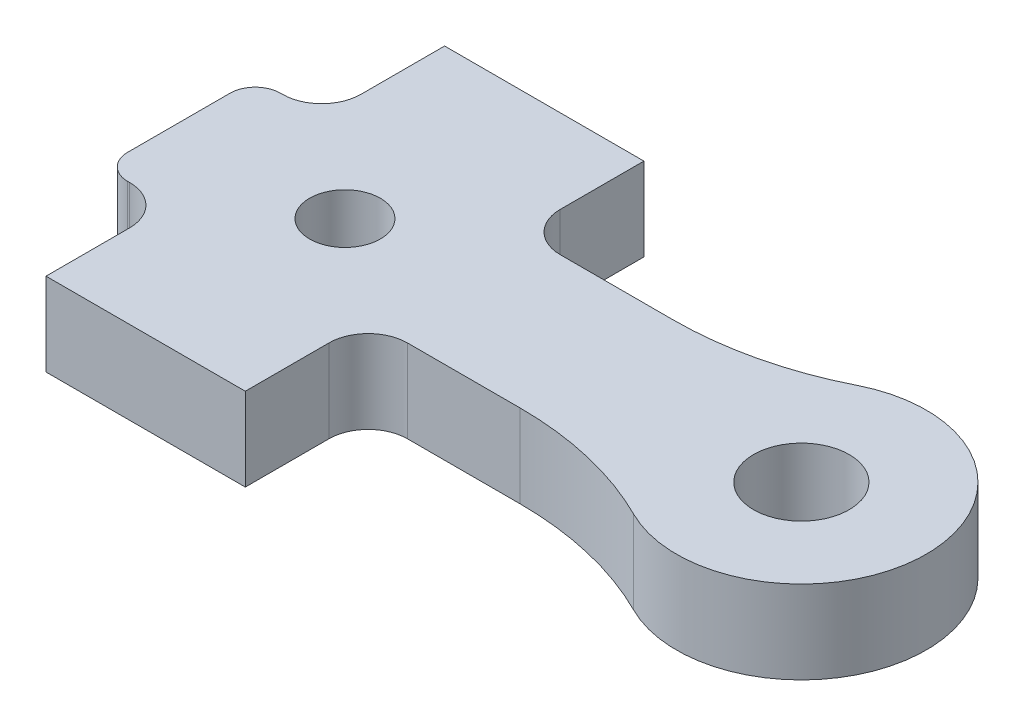
ISO-10303-21;
HEADER;
FILE_DESCRIPTION(('STEP AP214'),'2;1');
FILE_NAME('part.step','',(''),(''),'','','');
FILE_SCHEMA(('AUTOMOTIVE_DESIGN { 1 0 10303 214 1 1 1 1 }'));
ENDSEC;
DATA;
#1=APPLICATION_CONTEXT('core data for automotive mechanical design processes');
#2=APPLICATION_PROTOCOL_DEFINITION('international standard','automotive_design',2000,#1);
#3=PRODUCT_CONTEXT('',#1,'mechanical');
#4=PRODUCT('Part','Part','',(#3));
#5=PRODUCT_RELATED_PRODUCT_CATEGORY('part','',(#4));
#6=PRODUCT_DEFINITION_FORMATION('','',#4);
#7=PRODUCT_DEFINITION_CONTEXT('part definition',#1,'design');
#8=PRODUCT_DEFINITION('design','',#6,#7);
#9=PRODUCT_DEFINITION_SHAPE('','',#8);
#10=(LENGTH_UNIT() NAMED_UNIT(*) SI_UNIT(.MILLI.,.METRE.));
#11=(NAMED_UNIT(*) PLANE_ANGLE_UNIT() SI_UNIT($,.RADIAN.));
#12=(NAMED_UNIT(*) SI_UNIT($,.STERADIAN.) SOLID_ANGLE_UNIT());
#13=UNCERTAINTY_MEASURE_WITH_UNIT(LENGTH_MEASURE(1.E-05),#10,'distance_accuracy_value','');
#14=(GEOMETRIC_REPRESENTATION_CONTEXT(3) GLOBAL_UNCERTAINTY_ASSIGNED_CONTEXT((#13)) GLOBAL_UNIT_ASSIGNED_CONTEXT((#10,
#11,#12)) REPRESENTATION_CONTEXT('',''));
#15=CARTESIAN_POINT('',(0.,0.,0.));
#16=DIRECTION('',(0.,0.,1.));
#17=DIRECTION('',(1.,0.,0.));
#18=AXIS2_PLACEMENT_3D('',#15,#16,#17);
#19=CARTESIAN_POINT('',(7.9375,3.175,0.));
#20=DIRECTION('',(0.,1.,0.));
#21=DIRECTION('',(1.,0.,0.));
#22=AXIS2_PLACEMENT_3D('',#19,#20,#21);
#23=PLANE('',#22);
#24=CARTESIAN_POINT('',(17.4498,3.175,0.));
#25=DIRECTION('',(0.,-1.,0.));
#26=DIRECTION('',(1.,0.,0.));
#27=AXIS2_PLACEMENT_3D('',#24,#25,#26);
#28=CIRCLE('',#27,1.8288);
#29=CARTESIAN_POINT('',(15.621,3.175,0.));
#30=VERTEX_POINT('',#29);
#31=EDGE_CURVE('E172',#30,#30,#28,.T.);
#32=ORIENTED_EDGE('',*,*,#31,.T.);
#33=EDGE_LOOP('',(#32));
#34=FACE_BOUND('',#33,.T.);
#35=CARTESIAN_POINT('',(0.,3.175,0.));
#36=DIRECTION('',(0.,-1.,0.));
#37=DIRECTION('',(1.,0.,0.));
#38=AXIS2_PLACEMENT_3D('',#35,#36,#37);
#39=CIRCLE('',#38,1.35255);
#40=CARTESIAN_POINT('',(-1.35255,3.175,0.));
#41=VERTEX_POINT('',#40);
#42=EDGE_CURVE('E159',#41,#41,#39,.T.);
#43=ORIENTED_EDGE('',*,*,#42,.T.);
#44=EDGE_LOOP('',(#43));
#45=FACE_BOUND('',#44,.T.);
#46=CARTESIAN_POINT('',(-5.3848,3.175,-1.9558));
#47=DIRECTION('',(0.,-1.,0.));
#48=DIRECTION('',(-0.707106781186547,0.,-0.707106781186548));
#49=AXIS2_PLACEMENT_3D('',#46,#47,#48);
#50=CIRCLE('',#49,0.9652);
#51=CARTESIAN_POINT('',(-6.35,3.175,-1.9558));
#52=VERTEX_POINT('',#51);
#53=CARTESIAN_POINT('',(-5.3848,3.175,-2.921));
#54=VERTEX_POINT('',#53);
#55=EDGE_CURVE('E204',#52,#54,#50,.T.);
#56=ORIENTED_EDGE('',*,*,#55,.F.);
#57=DIRECTION('',(0.,0.,1.));
#58=VECTOR('',#57,1.);
#59=CARTESIAN_POINT('',(-6.35,3.175,-2.921));
#60=LINE('',#59,#58);
#61=CARTESIAN_POINT('',(-6.35,3.175,1.9558));
#62=VERTEX_POINT('',#61);
#63=EDGE_CURVE('E246',#52,#62,#60,.T.);
#64=ORIENTED_EDGE('',*,*,#63,.T.);
#65=CARTESIAN_POINT('',(-5.3848,3.175,1.9558));
#66=DIRECTION('',(0.,-1.,0.));
#67=DIRECTION('',(-0.707106781186547,0.,0.707106781186548));
#68=AXIS2_PLACEMENT_3D('',#65,#66,#67);
#69=CIRCLE('',#68,0.9652);
#70=CARTESIAN_POINT('',(-5.3848,3.175,2.921));
#71=VERTEX_POINT('',#70);
#72=EDGE_CURVE('E209',#71,#62,#69,.T.);
#73=ORIENTED_EDGE('',*,*,#72,.F.);
#74=DIRECTION('',(1.,0.,0.));
#75=VECTOR('',#74,1.);
#76=CARTESIAN_POINT('',(-6.35,3.175,2.921));
#77=LINE('',#76,#75);
#78=CARTESIAN_POINT('',(-5.31,3.175,2.921));
#79=VERTEX_POINT('',#78);
#80=EDGE_CURVE('E11',#71,#79,#77,.T.);
#81=ORIENTED_EDGE('',*,*,#80,.T.);
#82=CARTESIAN_POINT('',(-5.31,3.175,4.421));
#83=DIRECTION('',(0.,1.,0.));
#84=DIRECTION('',(0.707106781186548,0.,-0.707106781186547));
#85=AXIS2_PLACEMENT_3D('',#82,#83,#84);
#86=CIRCLE('',#85,1.5);
#87=CARTESIAN_POINT('',(-3.81,3.175,4.421));
#88=VERTEX_POINT('',#87);
#89=EDGE_CURVE('E327',#88,#79,#86,.T.);
#90=ORIENTED_EDGE('',*,*,#89,.F.);
#91=DIRECTION('',(0.,0.,1.));
#92=VECTOR('',#91,1.);
#93=CARTESIAN_POINT('',(-3.81,3.175,7.62));
#94=LINE('',#93,#92);
#95=CARTESIAN_POINT('',(-3.81,3.175,7.62));
#96=VERTEX_POINT('',#95);
#97=EDGE_CURVE('E244',#88,#96,#94,.T.);
#98=ORIENTED_EDGE('',*,*,#97,.T.);
#99=DIRECTION('',(1.,0.,0.));
#100=VECTOR('',#99,1.);
#101=CARTESIAN_POINT('',(3.81,3.175,7.62));
#102=LINE('',#101,#100);
#103=CARTESIAN_POINT('',(3.81,3.175,7.62));
#104=VERTEX_POINT('',#103);
#105=EDGE_CURVE('E26',#96,#104,#102,.T.);
#106=ORIENTED_EDGE('',*,*,#105,.T.);
#107=DIRECTION('',(0.,0.,-1.));
#108=VECTOR('',#107,1.);
#109=CARTESIAN_POINT('',(3.81,3.175,-7.62));
#110=LINE('',#109,#108);
#111=CARTESIAN_POINT('',(3.81,3.175,4.421));
#112=VERTEX_POINT('',#111);
#113=EDGE_CURVE('E218',#104,#112,#110,.T.);
#114=ORIENTED_EDGE('',*,*,#113,.T.);
#115=CARTESIAN_POINT('',(5.31,3.175,4.421));
#116=DIRECTION('',(0.,1.,0.));
#117=DIRECTION('',(-0.707106781186548,0.,-0.707106781186547));
#118=AXIS2_PLACEMENT_3D('',#115,#116,#117);
#119=CIRCLE('',#118,1.5);
#120=CARTESIAN_POINT('',(5.31,3.175,2.921));
#121=VERTEX_POINT('',#120);
#122=EDGE_CURVE('E282',#121,#112,#119,.T.);
#123=ORIENTED_EDGE('',*,*,#122,.F.);
#124=DIRECTION('',(1.,0.,0.));
#125=VECTOR('',#124,1.);
#126=CARTESIAN_POINT('',(-6.35,3.175,2.921));
#127=LINE('',#126,#125);
#128=CARTESIAN_POINT('',(9.61609244610192,3.175,2.921));
#129=VERTEX_POINT('',#128);
#130=EDGE_CURVE('E232',#121,#129,#127,.T.);
#131=ORIENTED_EDGE('',*,*,#130,.T.);
#132=CARTESIAN_POINT('',(9.61609244610192,3.175,15.621));
#133=DIRECTION('',(0.,1.,0.));
#134=DIRECTION('',(0.230330904529538,0.,-0.973112364744486));
#135=AXIS2_PLACEMENT_3D('',#132,#133,#134);
#136=CIRCLE('',#135,12.7);
#137=CARTESIAN_POINT('',(15.309193866086,3.175,4.26852906976744));
#138=VERTEX_POINT('',#137);
#139=EDGE_CURVE('E274',#138,#129,#136,.T.);
#140=ORIENTED_EDGE('',*,*,#139,.F.);
#141=CARTESIAN_POINT('',(17.4498,3.175,0.));
#142=DIRECTION('',(0.,1.,0.));
#143=DIRECTION('',(1.,0.,0.));
#144=AXIS2_PLACEMENT_3D('',#141,#142,#143);
#145=CIRCLE('',#144,4.7752);
#146=CARTESIAN_POINT('',(15.309193866086,3.175,-4.26852906976744));
#147=VERTEX_POINT('',#146);
#148=EDGE_CURVE('E277',#138,#147,#145,.T.);
#149=ORIENTED_EDGE('',*,*,#148,.T.);
#150=CARTESIAN_POINT('',(9.61609244610192,3.175,-15.621));
#151=DIRECTION('',(0.,1.,0.));
#152=DIRECTION('',(0.230330904529538,0.,0.973112364744486));
#153=AXIS2_PLACEMENT_3D('',#150,#151,#152);
#154=CIRCLE('',#153,12.7);
#155=CARTESIAN_POINT('',(9.61609244610192,3.175,-2.921));
#156=VERTEX_POINT('',#155);
#157=EDGE_CURVE('E187',#156,#147,#154,.T.);
#158=ORIENTED_EDGE('',*,*,#157,.F.);
#159=DIRECTION('',(-1.,0.,0.));
#160=VECTOR('',#159,1.);
#161=CARTESIAN_POINT('',(22.225,3.175,-2.921));
#162=LINE('',#161,#160);
#163=CARTESIAN_POINT('',(5.31,3.175,-2.921));
#164=VERTEX_POINT('',#163);
#165=EDGE_CURVE('E239',#156,#164,#162,.T.);
#166=ORIENTED_EDGE('',*,*,#165,.T.);
#167=CARTESIAN_POINT('',(5.31,3.175,-4.421));
#168=DIRECTION('',(0.,1.,0.));
#169=DIRECTION('',(-0.707106781186548,0.,0.707106781186547));
#170=AXIS2_PLACEMENT_3D('',#167,#168,#169);
#171=CIRCLE('',#170,1.5);
#172=CARTESIAN_POINT('',(3.81,3.175,-4.421));
#173=VERTEX_POINT('',#172);
#174=EDGE_CURVE('E185',#173,#164,#171,.T.);
#175=ORIENTED_EDGE('',*,*,#174,.F.);
#176=DIRECTION('',(0.,0.,-1.));
#177=VECTOR('',#176,1.);
#178=CARTESIAN_POINT('',(3.81,3.175,-7.62));
#179=LINE('',#178,#177);
#180=CARTESIAN_POINT('',(3.81,3.175,-7.62));
#181=VERTEX_POINT('',#180);
#182=EDGE_CURVE('E198',#173,#181,#179,.T.);
#183=ORIENTED_EDGE('',*,*,#182,.T.);
#184=DIRECTION('',(-1.,0.,0.));
#185=VECTOR('',#184,1.);
#186=CARTESIAN_POINT('',(-3.81,3.175,-7.62));
#187=LINE('',#186,#185);
#188=CARTESIAN_POINT('',(-3.81,3.175,-7.62));
#189=VERTEX_POINT('',#188);
#190=EDGE_CURVE('E215',#181,#189,#187,.T.);
#191=ORIENTED_EDGE('',*,*,#190,.T.);
#192=DIRECTION('',(0.,0.,1.));
#193=VECTOR('',#192,1.);
#194=CARTESIAN_POINT('',(-3.81,3.175,7.62));
#195=LINE('',#194,#193);
#196=CARTESIAN_POINT('',(-3.81,3.175,-4.421));
#197=VERTEX_POINT('',#196);
#198=EDGE_CURVE('E163',#189,#197,#195,.T.);
#199=ORIENTED_EDGE('',*,*,#198,.T.);
#200=CARTESIAN_POINT('',(-5.31,3.175,-4.421));
#201=DIRECTION('',(0.,1.,0.));
#202=DIRECTION('',(0.707106781186548,0.,0.707106781186547));
#203=AXIS2_PLACEMENT_3D('',#200,#201,#202);
#204=CIRCLE('',#203,1.5);
#205=CARTESIAN_POINT('',(-5.31,3.175,-2.921));
#206=VERTEX_POINT('',#205);
#207=EDGE_CURVE('E180',#206,#197,#204,.T.);
#208=ORIENTED_EDGE('',*,*,#207,.F.);
#209=DIRECTION('',(-1.,0.,0.));
#210=VECTOR('',#209,1.);
#211=CARTESIAN_POINT('',(22.225,3.175,-2.921));
#212=LINE('',#211,#210);
#213=EDGE_CURVE('E295',#206,#54,#212,.T.);
#214=ORIENTED_EDGE('',*,*,#213,.T.);
#215=EDGE_LOOP('',(#56,#64,#73,#81,#90,#98,#106,#114,#123,#131,#140,#149,#158,#166,#175,#183,
#191,#199,#208,#214));
#216=FACE_BOUND('',#215,.T.);
#217=ADVANCED_FACE('F16',(#34,#45,#216),#23,.T.);
#218=CARTESIAN_POINT('',(-6.35,0.,2.921));
#219=DIRECTION('',(0.,0.,1.));
#220=DIRECTION('',(1.,0.,0.));
#221=AXIS2_PLACEMENT_3D('',#218,#219,#220);
#222=PLANE('',#221);
#223=DIRECTION('',(0.,-1.,0.));
#224=VECTOR('',#223,1.);
#225=CARTESIAN_POINT('',(-5.31,0.,2.921));
#226=LINE('',#225,#224);
#227=CARTESIAN_POINT('',(-5.31,0.,2.921));
#228=VERTEX_POINT('',#227);
#229=EDGE_CURVE('E323',#79,#228,#226,.T.);
#230=ORIENTED_EDGE('',*,*,#229,.F.);
#231=ORIENTED_EDGE('',*,*,#80,.F.);
#232=DIRECTION('',(0.,1.,0.));
#233=VECTOR('',#232,1.);
#234=CARTESIAN_POINT('',(-5.3848,0.,2.921));
#235=LINE('',#234,#233);
#236=CARTESIAN_POINT('',(-5.3848,0.,2.921));
#237=VERTEX_POINT('',#236);
#238=EDGE_CURVE('E205',#237,#71,#235,.T.);
#239=ORIENTED_EDGE('',*,*,#238,.F.);
#240=DIRECTION('',(1.,0.,0.));
#241=VECTOR('',#240,1.);
#242=CARTESIAN_POINT('',(-6.35,0.,2.921));
#243=LINE('',#242,#241);
#244=EDGE_CURVE('E300',#237,#228,#243,.T.);
#245=ORIENTED_EDGE('',*,*,#244,.T.);
#246=EDGE_LOOP('',(#230,#231,#239,#245));
#247=FACE_BOUND('',#246,.T.);
#248=ADVANCED_FACE('F393',(#247),#222,.T.);
#249=CARTESIAN_POINT('',(-3.81,0.,7.62));
#250=DIRECTION('',(0.,0.,1.));
#251=DIRECTION('',(1.,0.,0.));
#252=AXIS2_PLACEMENT_3D('',#249,#250,#251);
#253=PLANE('',#252);
#254=DIRECTION('',(-1.,0.,0.));
#255=VECTOR('',#254,1.);
#256=CARTESIAN_POINT('',(3.81,0.,7.62));
#257=LINE('',#256,#255);
#258=CARTESIAN_POINT('',(3.81,0.,7.62));
#259=VERTEX_POINT('',#258);
#260=CARTESIAN_POINT('',(-3.81,0.,7.62));
#261=VERTEX_POINT('',#260);
#262=EDGE_CURVE('E338',#259,#261,#257,.T.);
#263=ORIENTED_EDGE('',*,*,#262,.F.);
#264=DIRECTION('',(0.,1.,0.));
#265=VECTOR('',#264,1.);
#266=CARTESIAN_POINT('',(3.81,0.,7.62));
#267=LINE('',#266,#265);
#268=EDGE_CURVE('E301',#259,#104,#267,.T.);
#269=ORIENTED_EDGE('',*,*,#268,.T.);
#270=ORIENTED_EDGE('',*,*,#105,.F.);
#271=DIRECTION('',(0.,1.,0.));
#272=VECTOR('',#271,1.);
#273=CARTESIAN_POINT('',(-3.81,0.,7.62));
#274=LINE('',#273,#272);
#275=EDGE_CURVE('E240',#261,#96,#274,.T.);
#276=ORIENTED_EDGE('',*,*,#275,.F.);
#277=EDGE_LOOP('',(#263,#269,#270,#276));
#278=FACE_BOUND('',#277,.T.);
#279=ADVANCED_FACE('F531',(#278),#253,.T.);
#280=CARTESIAN_POINT('',(3.81,0.,7.62));
#281=DIRECTION('',(1.,0.,0.));
#282=DIRECTION('',(0.,1.,0.));
#283=AXIS2_PLACEMENT_3D('',#280,#281,#282);
#284=PLANE('',#283);
#285=DIRECTION('',(0.,-1.,0.));
#286=VECTOR('',#285,1.);
#287=CARTESIAN_POINT('',(3.81,0.,4.421));
#288=LINE('',#287,#286);
#289=CARTESIAN_POINT('',(3.81,0.,4.421));
#290=VERTEX_POINT('',#289);
#291=EDGE_CURVE('E286',#112,#290,#288,.T.);
#292=ORIENTED_EDGE('',*,*,#291,.F.);
#293=ORIENTED_EDGE('',*,*,#113,.F.);
#294=ORIENTED_EDGE('',*,*,#268,.F.);
#295=DIRECTION('',(0.,0.,1.));
#296=VECTOR('',#295,1.);
#297=CARTESIAN_POINT('',(3.81,0.,-7.62));
#298=LINE('',#297,#296);
#299=EDGE_CURVE('E482',#290,#259,#298,.T.);
#300=ORIENTED_EDGE('',*,*,#299,.F.);
#301=EDGE_LOOP('',(#292,#293,#294,#300));
#302=FACE_BOUND('',#301,.T.);
#303=ADVANCED_FACE('F528',(#302),#284,.T.);
#304=CARTESIAN_POINT('',(3.81,0.,-7.62));
#305=DIRECTION('',(0.,0.,-1.));
#306=DIRECTION('',(0.,-1.,0.));
#307=AXIS2_PLACEMENT_3D('',#304,#305,#306);
#308=PLANE('',#307);
#309=DIRECTION('',(1.,0.,0.));
#310=VECTOR('',#309,1.);
#311=CARTESIAN_POINT('',(-3.81,0.,-7.62));
#312=LINE('',#311,#310);
#313=CARTESIAN_POINT('',(-3.81,0.,-7.62));
#314=VERTEX_POINT('',#313);
#315=CARTESIAN_POINT('',(3.81,0.,-7.62));
#316=VERTEX_POINT('',#315);
#317=EDGE_CURVE('E272',#314,#316,#312,.T.);
#318=ORIENTED_EDGE('',*,*,#317,.F.);
#319=DIRECTION('',(0.,1.,0.));
#320=VECTOR('',#319,1.);
#321=CARTESIAN_POINT('',(-3.81,0.,-7.62));
#322=LINE('',#321,#320);
#323=EDGE_CURVE('E219',#314,#189,#322,.T.);
#324=ORIENTED_EDGE('',*,*,#323,.T.);
#325=ORIENTED_EDGE('',*,*,#190,.F.);
#326=DIRECTION('',(0.,1.,0.));
#327=VECTOR('',#326,1.);
#328=CARTESIAN_POINT('',(3.81,0.,-7.62));
#329=LINE('',#328,#327);
#330=EDGE_CURVE('E223',#316,#181,#329,.T.);
#331=ORIENTED_EDGE('',*,*,#330,.F.);
#332=EDGE_LOOP('',(#318,#324,#325,#331));
#333=FACE_BOUND('',#332,.T.);
#334=ADVANCED_FACE('F458',(#333),#308,.T.);
#335=CARTESIAN_POINT('',(-3.81,0.,-7.62));
#336=DIRECTION('',(-1.,0.,0.));
#337=DIRECTION('',(0.,0.,1.));
#338=AXIS2_PLACEMENT_3D('',#335,#336,#337);
#339=PLANE('',#338);
#340=DIRECTION('',(0.,-1.,0.));
#341=VECTOR('',#340,1.);
#342=CARTESIAN_POINT('',(-3.81,0.,-4.421));
#343=LINE('',#342,#341);
#344=CARTESIAN_POINT('',(-3.81,0.,-4.421));
#345=VERTEX_POINT('',#344);
#346=EDGE_CURVE('E176',#197,#345,#343,.T.);
#347=ORIENTED_EDGE('',*,*,#346,.F.);
#348=ORIENTED_EDGE('',*,*,#198,.F.);
#349=ORIENTED_EDGE('',*,*,#323,.F.);
#350=DIRECTION('',(0.,0.,-1.));
#351=VECTOR('',#350,1.);
#352=CARTESIAN_POINT('',(-3.81,0.,7.62));
#353=LINE('',#352,#351);
#354=EDGE_CURVE('E249',#345,#314,#353,.T.);
#355=ORIENTED_EDGE('',*,*,#354,.F.);
#356=EDGE_LOOP('',(#347,#348,#349,#355));
#357=FACE_BOUND('',#356,.T.);
#358=ADVANCED_FACE('F460',(#357),#339,.T.);
#359=CARTESIAN_POINT('',(0.,0.,0.));
#360=DIRECTION('',(0.,1.,0.));
#361=DIRECTION('',(1.,0.,0.));
#362=AXIS2_PLACEMENT_3D('',#359,#360,#361);
#363=CYLINDRICAL_SURFACE('',#362,1.35255);
#364=ORIENTED_EDGE('',*,*,#42,.F.);
#365=DIRECTION('',(0.,-1.,0.));
#366=VECTOR('',#365,1.);
#367=CARTESIAN_POINT('',(-1.35255,0.,0.));
#368=LINE('',#367,#366);
#369=CARTESIAN_POINT('',(-1.35255,0.,0.));
#370=VERTEX_POINT('',#369);
#371=EDGE_CURVE('E156',#41,#370,#368,.T.);
#372=ORIENTED_EDGE('',*,*,#371,.T.);
#373=CARTESIAN_POINT('',(0.,0.,0.));
#374=DIRECTION('',(0.,-1.,0.));
#375=DIRECTION('',(1.,0.,0.));
#376=AXIS2_PLACEMENT_3D('',#373,#374,#375);
#377=CIRCLE('',#376,1.35255);
#378=EDGE_CURVE('E161',#370,#370,#377,.T.);
#379=ORIENTED_EDGE('',*,*,#378,.T.);
#380=ORIENTED_EDGE('',*,*,#371,.F.);
#381=EDGE_LOOP('',(#364,#372,#379,#380));
#382=FACE_BOUND('',#381,.T.);
#383=ADVANCED_FACE('F158',(#382),#363,.F.);
#384=CARTESIAN_POINT('',(17.4498,0.,0.));
#385=DIRECTION('',(0.,1.,0.));
#386=DIRECTION('',(1.,0.,0.));
#387=AXIS2_PLACEMENT_3D('',#384,#385,#386);
#388=CYLINDRICAL_SURFACE('',#387,1.8288);
#389=ORIENTED_EDGE('',*,*,#31,.F.);
#390=DIRECTION('',(0.,-1.,0.));
#391=VECTOR('',#390,1.);
#392=CARTESIAN_POINT('',(15.621,0.,0.));
#393=LINE('',#392,#391);
#394=CARTESIAN_POINT('',(15.621,0.,0.));
#395=VERTEX_POINT('',#394);
#396=EDGE_CURVE('E167',#30,#395,#393,.T.);
#397=ORIENTED_EDGE('',*,*,#396,.T.);
#398=CARTESIAN_POINT('',(17.4498,0.,0.));
#399=DIRECTION('',(0.,-1.,0.));
#400=DIRECTION('',(1.,0.,0.));
#401=AXIS2_PLACEMENT_3D('',#398,#399,#400);
#402=CIRCLE('',#401,1.8288);
#403=EDGE_CURVE('E315',#395,#395,#402,.T.);
#404=ORIENTED_EDGE('',*,*,#403,.T.);
#405=ORIENTED_EDGE('',*,*,#396,.F.);
#406=EDGE_LOOP('',(#389,#397,#404,#405));
#407=FACE_BOUND('',#406,.T.);
#408=ADVANCED_FACE('F560',(#407),#388,.F.);
#409=CARTESIAN_POINT('',(-5.3848,0.,1.9558));
#410=DIRECTION('',(0.,1.,0.));
#411=DIRECTION('',(-0.707106781186547,0.,0.707106781186548));
#412=AXIS2_PLACEMENT_3D('',#409,#410,#411);
#413=CYLINDRICAL_SURFACE('',#412,0.9652);
#414=ORIENTED_EDGE('',*,*,#72,.T.);
#415=DIRECTION('',(0.,-1.,0.));
#416=VECTOR('',#415,1.);
#417=CARTESIAN_POINT('',(-6.35,0.,1.9558));
#418=LINE('',#417,#416);
#419=CARTESIAN_POINT('',(-6.35,0.,1.9558));
#420=VERTEX_POINT('',#419);
#421=EDGE_CURVE('E250',#62,#420,#418,.T.);
#422=ORIENTED_EDGE('',*,*,#421,.T.);
#423=CARTESIAN_POINT('',(-5.3848,0.,1.9558));
#424=DIRECTION('',(0.,1.,0.));
#425=DIRECTION('',(-0.707106781186547,0.,0.707106781186548));
#426=AXIS2_PLACEMENT_3D('',#423,#424,#425);
#427=CIRCLE('',#426,0.9652);
#428=EDGE_CURVE('E296',#420,#237,#427,.T.);
#429=ORIENTED_EDGE('',*,*,#428,.T.);
#430=ORIENTED_EDGE('',*,*,#238,.T.);
#431=EDGE_LOOP('',(#414,#422,#429,#430));
#432=FACE_BOUND('',#431,.T.);
#433=ADVANCED_FACE('F375',(#432),#413,.T.);
#434=CARTESIAN_POINT('',(7.9375,0.,0.));
#435=DIRECTION('',(0.,1.,0.));
#436=DIRECTION('',(1.,0.,0.));
#437=AXIS2_PLACEMENT_3D('',#434,#435,#436);
#438=PLANE('',#437);
#439=ORIENTED_EDGE('',*,*,#403,.F.);
#440=EDGE_LOOP('',(#439));
#441=FACE_BOUND('',#440,.T.);
#442=ORIENTED_EDGE('',*,*,#378,.F.);
#443=EDGE_LOOP('',(#442));
#444=FACE_BOUND('',#443,.T.);
#445=CARTESIAN_POINT('',(-5.3848,0.,-1.9558));
#446=DIRECTION('',(0.,1.,0.));
#447=DIRECTION('',(-0.707106781186547,0.,-0.707106781186548));
#448=AXIS2_PLACEMENT_3D('',#445,#446,#447);
#449=CIRCLE('',#448,0.9652);
#450=CARTESIAN_POINT('',(-5.3848,0.,-2.921));
#451=VERTEX_POINT('',#450);
#452=CARTESIAN_POINT('',(-6.35,0.,-1.9558));
#453=VERTEX_POINT('',#452);
#454=EDGE_CURVE('E199',#451,#453,#449,.T.);
#455=ORIENTED_EDGE('',*,*,#454,.F.);
#456=DIRECTION('',(-1.,0.,0.));
#457=VECTOR('',#456,1.);
#458=CARTESIAN_POINT('',(22.225,0.,-2.921));
#459=LINE('',#458,#457);
#460=CARTESIAN_POINT('',(-5.31,0.,-2.921));
#461=VERTEX_POINT('',#460);
#462=EDGE_CURVE('E179',#461,#451,#459,.T.);
#463=ORIENTED_EDGE('',*,*,#462,.F.);
#464=CARTESIAN_POINT('',(-5.31,0.,-4.421));
#465=DIRECTION('',(0.,-1.,0.));
#466=DIRECTION('',(0.707106781186548,0.,0.707106781186547));
#467=AXIS2_PLACEMENT_3D('',#464,#465,#466);
#468=CIRCLE('',#467,1.5);
#469=EDGE_CURVE('E214',#345,#461,#468,.T.);
#470=ORIENTED_EDGE('',*,*,#469,.F.);
#471=ORIENTED_EDGE('',*,*,#354,.T.);
#472=ORIENTED_EDGE('',*,*,#317,.T.);
#473=DIRECTION('',(0.,0.,1.));
#474=VECTOR('',#473,1.);
#475=CARTESIAN_POINT('',(3.81,0.,-7.62));
#476=LINE('',#475,#474);
#477=CARTESIAN_POINT('',(3.81,0.,-4.421));
#478=VERTEX_POINT('',#477);
#479=EDGE_CURVE('E227',#316,#478,#476,.T.);
#480=ORIENTED_EDGE('',*,*,#479,.T.);
#481=CARTESIAN_POINT('',(5.31,0.,-4.421));
#482=DIRECTION('',(0.,-1.,0.));
#483=DIRECTION('',(-0.707106781186548,0.,0.707106781186547));
#484=AXIS2_PLACEMENT_3D('',#481,#482,#483);
#485=CIRCLE('',#484,1.5);
#486=CARTESIAN_POINT('',(5.31,0.,-2.921));
#487=VERTEX_POINT('',#486);
#488=EDGE_CURVE('E186',#487,#478,#485,.T.);
#489=ORIENTED_EDGE('',*,*,#488,.F.);
#490=DIRECTION('',(-1.,0.,0.));
#491=VECTOR('',#490,1.);
#492=CARTESIAN_POINT('',(22.225,0.,-2.921));
#493=LINE('',#492,#491);
#494=CARTESIAN_POINT('',(9.61609244610192,0.,-2.921));
#495=VERTEX_POINT('',#494);
#496=EDGE_CURVE('E234',#495,#487,#493,.T.);
#497=ORIENTED_EDGE('',*,*,#496,.F.);
#498=CARTESIAN_POINT('',(9.61609244610192,0.,-15.621));
#499=DIRECTION('',(0.,-1.,0.));
#500=DIRECTION('',(0.230330904529538,0.,0.973112364744486));
#501=AXIS2_PLACEMENT_3D('',#498,#499,#500);
#502=CIRCLE('',#501,12.7);
#503=CARTESIAN_POINT('',(15.309193866086,0.,-4.26852906976744));
#504=VERTEX_POINT('',#503);
#505=EDGE_CURVE('E290',#504,#495,#502,.T.);
#506=ORIENTED_EDGE('',*,*,#505,.F.);
#507=CARTESIAN_POINT('',(17.4498,0.,0.));
#508=DIRECTION('',(0.,1.,0.));
#509=DIRECTION('',(1.,0.,0.));
#510=AXIS2_PLACEMENT_3D('',#507,#508,#509);
#511=CIRCLE('',#510,4.7752);
#512=CARTESIAN_POINT('',(15.309193866086,0.,4.26852906976744));
#513=VERTEX_POINT('',#512);
#514=EDGE_CURVE('E319',#513,#504,#511,.T.);
#515=ORIENTED_EDGE('',*,*,#514,.F.);
#516=CARTESIAN_POINT('',(9.61609244610192,0.,15.621));
#517=DIRECTION('',(0.,-1.,0.));
#518=DIRECTION('',(0.230330904529538,0.,-0.973112364744486));
#519=AXIS2_PLACEMENT_3D('',#516,#517,#518);
#520=CIRCLE('',#519,12.7);
#521=CARTESIAN_POINT('',(9.61609244610192,0.,2.921));
#522=VERTEX_POINT('',#521);
#523=EDGE_CURVE('E238',#522,#513,#520,.T.);
#524=ORIENTED_EDGE('',*,*,#523,.F.);
#525=DIRECTION('',(1.,0.,0.));
#526=VECTOR('',#525,1.);
#527=CARTESIAN_POINT('',(-6.35,0.,2.921));
#528=LINE('',#527,#526);
#529=CARTESIAN_POINT('',(5.31,0.,2.921));
#530=VERTEX_POINT('',#529);
#531=EDGE_CURVE('E233',#530,#522,#528,.T.);
#532=ORIENTED_EDGE('',*,*,#531,.F.);
#533=CARTESIAN_POINT('',(5.31,0.,4.421));
#534=DIRECTION('',(0.,-1.,0.));
#535=DIRECTION('',(-0.707106781186548,0.,-0.707106781186547));
#536=AXIS2_PLACEMENT_3D('',#533,#534,#535);
#537=CIRCLE('',#536,1.5);
#538=EDGE_CURVE('E193',#290,#530,#537,.T.);
#539=ORIENTED_EDGE('',*,*,#538,.F.);
#540=ORIENTED_EDGE('',*,*,#299,.T.);
#541=ORIENTED_EDGE('',*,*,#262,.T.);
#542=DIRECTION('',(0.,0.,-1.));
#543=VECTOR('',#542,1.);
#544=CARTESIAN_POINT('',(-3.81,0.,7.62));
#545=LINE('',#544,#543);
#546=CARTESIAN_POINT('',(-3.81,0.,4.421));
#547=VERTEX_POINT('',#546);
#548=EDGE_CURVE('E245',#261,#547,#545,.T.);
#549=ORIENTED_EDGE('',*,*,#548,.T.);
#550=CARTESIAN_POINT('',(-5.31,0.,4.421));
#551=DIRECTION('',(0.,-1.,0.));
#552=DIRECTION('',(0.707106781186548,0.,-0.707106781186547));
#553=AXIS2_PLACEMENT_3D('',#550,#551,#552);
#554=CIRCLE('',#553,1.5);
#555=EDGE_CURVE('E390',#228,#547,#554,.T.);
#556=ORIENTED_EDGE('',*,*,#555,.F.);
#557=ORIENTED_EDGE('',*,*,#244,.F.);
#558=ORIENTED_EDGE('',*,*,#428,.F.);
#559=DIRECTION('',(0.,0.,1.));
#560=VECTOR('',#559,1.);
#561=CARTESIAN_POINT('',(-6.35,0.,-2.921));
#562=LINE('',#561,#560);
#563=EDGE_CURVE('E367',#453,#420,#562,.T.);
#564=ORIENTED_EDGE('',*,*,#563,.F.);
#565=EDGE_LOOP('',(#455,#463,#470,#471,#472,#480,#489,#497,#506,#515,#524,#532,#539,#540,#541,
#549,#556,#557,#558,#564));
#566=FACE_BOUND('',#565,.T.);
#567=ADVANCED_FACE('F387',(#441,#444,#566),#438,.F.);
#568=CARTESIAN_POINT('',(-6.35,0.,-2.921));
#569=DIRECTION('',(-1.,0.,0.));
#570=DIRECTION('',(0.,0.,1.));
#571=AXIS2_PLACEMENT_3D('',#568,#569,#570);
#572=PLANE('',#571);
#573=DIRECTION('',(0.,1.,0.));
#574=VECTOR('',#573,1.);
#575=CARTESIAN_POINT('',(-6.35,0.,-1.9558));
#576=LINE('',#575,#574);
#577=EDGE_CURVE('E203',#453,#52,#576,.T.);
#578=ORIENTED_EDGE('',*,*,#577,.F.);
#579=ORIENTED_EDGE('',*,*,#563,.T.);
#580=ORIENTED_EDGE('',*,*,#421,.F.);
#581=ORIENTED_EDGE('',*,*,#63,.F.);
#582=EDGE_LOOP('',(#578,#579,#580,#581));
#583=FACE_BOUND('',#582,.T.);
#584=ADVANCED_FACE('F384',(#583),#572,.T.);
#585=CARTESIAN_POINT('',(-5.3848,0.,-1.9558));
#586=DIRECTION('',(0.,1.,0.));
#587=DIRECTION('',(-0.707106781186547,0.,-0.707106781186548));
#588=AXIS2_PLACEMENT_3D('',#585,#586,#587);
#589=CYLINDRICAL_SURFACE('',#588,0.9652);
#590=ORIENTED_EDGE('',*,*,#55,.T.);
#591=DIRECTION('',(0.,-1.,0.));
#592=VECTOR('',#591,1.);
#593=CARTESIAN_POINT('',(-5.3848,0.,-2.921));
#594=LINE('',#593,#592);
#595=EDGE_CURVE('E291',#54,#451,#594,.T.);
#596=ORIENTED_EDGE('',*,*,#595,.T.);
#597=ORIENTED_EDGE('',*,*,#454,.T.);
#598=ORIENTED_EDGE('',*,*,#577,.T.);
#599=EDGE_LOOP('',(#590,#596,#597,#598));
#600=FACE_BOUND('',#599,.T.);
#601=ADVANCED_FACE('F473',(#600),#589,.T.);
#602=CARTESIAN_POINT('',(17.4498,0.,0.));
#603=DIRECTION('',(0.,1.,0.));
#604=DIRECTION('',(1.,0.,0.));
#605=AXIS2_PLACEMENT_3D('',#602,#603,#604);
#606=CYLINDRICAL_SURFACE('',#605,4.7752);
#607=DIRECTION('',(0.,-1.,0.));
#608=VECTOR('',#607,1.);
#609=CARTESIAN_POINT('',(15.309193866086,0.,-4.26852906976744));
#610=LINE('',#609,#608);
#611=EDGE_CURVE('E191',#147,#504,#610,.T.);
#612=ORIENTED_EDGE('',*,*,#611,.F.);
#613=ORIENTED_EDGE('',*,*,#148,.F.);
#614=DIRECTION('',(0.,1.,0.));
#615=VECTOR('',#614,1.);
#616=CARTESIAN_POINT('',(15.309193866086,0.,4.26852906976744));
#617=LINE('',#616,#615);
#618=EDGE_CURVE('E278',#513,#138,#617,.T.);
#619=ORIENTED_EDGE('',*,*,#618,.F.);
#620=ORIENTED_EDGE('',*,*,#514,.T.);
#621=EDGE_LOOP('',(#612,#613,#619,#620));
#622=FACE_BOUND('',#621,.T.);
#623=ADVANCED_FACE('F512',(#622),#606,.T.);
#624=CARTESIAN_POINT('',(9.61609244610192,0.,15.621));
#625=DIRECTION('',(0.,1.,0.));
#626=DIRECTION('',(0.230330904529538,0.,-0.973112364744486));
#627=AXIS2_PLACEMENT_3D('',#624,#625,#626);
#628=CYLINDRICAL_SURFACE('',#627,12.7);
#629=ORIENTED_EDGE('',*,*,#523,.T.);
#630=ORIENTED_EDGE('',*,*,#618,.T.);
#631=ORIENTED_EDGE('',*,*,#139,.T.);
#632=DIRECTION('',(0.,-1.,0.));
#633=VECTOR('',#632,1.);
#634=CARTESIAN_POINT('',(9.61609244610192,0.,2.921));
#635=LINE('',#634,#633);
#636=EDGE_CURVE('E228',#129,#522,#635,.T.);
#637=ORIENTED_EDGE('',*,*,#636,.T.);
#638=EDGE_LOOP('',(#629,#630,#631,#637));
#639=FACE_BOUND('',#638,.T.);
#640=ADVANCED_FACE('F507',(#639),#628,.F.);
#641=CARTESIAN_POINT('',(13.6721957274484,0.,-2.921));
#642=DIRECTION('',(0.,0.,-1.));
#643=DIRECTION('',(0.,-1.,0.));
#644=AXIS2_PLACEMENT_3D('',#641,#642,#643);
#645=PLANE('',#644);
#646=DIRECTION('',(0.,-1.,0.));
#647=VECTOR('',#646,1.);
#648=CARTESIAN_POINT('',(5.31,0.,-2.921));
#649=LINE('',#648,#647);
#650=EDGE_CURVE('E251',#164,#487,#649,.T.);
#651=ORIENTED_EDGE('',*,*,#650,.F.);
#652=ORIENTED_EDGE('',*,*,#165,.F.);
#653=DIRECTION('',(0.,1.,0.));
#654=VECTOR('',#653,1.);
#655=CARTESIAN_POINT('',(9.61609244610192,0.,-2.921));
#656=LINE('',#655,#654);
#657=EDGE_CURVE('E192',#495,#156,#656,.T.);
#658=ORIENTED_EDGE('',*,*,#657,.F.);
#659=ORIENTED_EDGE('',*,*,#496,.T.);
#660=EDGE_LOOP('',(#651,#652,#658,#659));
#661=FACE_BOUND('',#660,.T.);
#662=ADVANCED_FACE('F444',(#661),#645,.T.);
#663=CARTESIAN_POINT('',(9.61609244610192,0.,-15.621));
#664=DIRECTION('',(0.,1.,0.));
#665=DIRECTION('',(0.230330904529538,0.,0.973112364744486));
#666=AXIS2_PLACEMENT_3D('',#663,#664,#665);
#667=CYLINDRICAL_SURFACE('',#666,12.7);
#668=ORIENTED_EDGE('',*,*,#505,.T.);
#669=ORIENTED_EDGE('',*,*,#657,.T.);
#670=ORIENTED_EDGE('',*,*,#157,.T.);
#671=ORIENTED_EDGE('',*,*,#611,.T.);
#672=EDGE_LOOP('',(#668,#669,#670,#671));
#673=FACE_BOUND('',#672,.T.);
#674=ADVANCED_FACE('F548',(#673),#667,.F.);
#675=CARTESIAN_POINT('',(3.81,0.,2.921));
#676=DIRECTION('',(0.,0.,1.));
#677=DIRECTION('',(1.,0.,0.));
#678=AXIS2_PLACEMENT_3D('',#675,#676,#677);
#679=PLANE('',#678);
#680=DIRECTION('',(0.,1.,0.));
#681=VECTOR('',#680,1.);
#682=CARTESIAN_POINT('',(5.31,0.,2.921));
#683=LINE('',#682,#681);
#684=EDGE_CURVE('E197',#530,#121,#683,.T.);
#685=ORIENTED_EDGE('',*,*,#684,.F.);
#686=ORIENTED_EDGE('',*,*,#531,.T.);
#687=ORIENTED_EDGE('',*,*,#636,.F.);
#688=ORIENTED_EDGE('',*,*,#130,.F.);
#689=EDGE_LOOP('',(#685,#686,#687,#688));
#690=FACE_BOUND('',#689,.T.);
#691=ADVANCED_FACE('F520',(#690),#679,.T.);
#692=CARTESIAN_POINT('',(5.31,0.,4.421));
#693=DIRECTION('',(0.,1.,0.));
#694=DIRECTION('',(-0.707106781186548,0.,-0.707106781186547));
#695=AXIS2_PLACEMENT_3D('',#692,#693,#694);
#696=CYLINDRICAL_SURFACE('',#695,1.5);
#697=ORIENTED_EDGE('',*,*,#538,.T.);
#698=ORIENTED_EDGE('',*,*,#684,.T.);
#699=ORIENTED_EDGE('',*,*,#122,.T.);
#700=ORIENTED_EDGE('',*,*,#291,.T.);
#701=EDGE_LOOP('',(#697,#698,#699,#700));
#702=FACE_BOUND('',#701,.T.);
#703=ADVANCED_FACE('F523',(#702),#696,.F.);
#704=CARTESIAN_POINT('',(3.81,0.,-2.921));
#705=DIRECTION('',(1.,0.,0.));
#706=DIRECTION('',(0.,1.,0.));
#707=AXIS2_PLACEMENT_3D('',#704,#705,#706);
#708=PLANE('',#707);
#709=DIRECTION('',(0.,1.,0.));
#710=VECTOR('',#709,1.);
#711=CARTESIAN_POINT('',(3.81,0.,-4.421));
#712=LINE('',#711,#710);
#713=EDGE_CURVE('E181',#478,#173,#712,.T.);
#714=ORIENTED_EDGE('',*,*,#713,.F.);
#715=ORIENTED_EDGE('',*,*,#479,.F.);
#716=ORIENTED_EDGE('',*,*,#330,.T.);
#717=ORIENTED_EDGE('',*,*,#182,.F.);
#718=EDGE_LOOP('',(#714,#715,#716,#717));
#719=FACE_BOUND('',#718,.T.);
#720=ADVANCED_FACE('F451',(#719),#708,.T.);
#721=CARTESIAN_POINT('',(5.31,0.,-4.421));
#722=DIRECTION('',(0.,1.,0.));
#723=DIRECTION('',(-0.707106781186548,0.,0.707106781186547));
#724=AXIS2_PLACEMENT_3D('',#721,#722,#723);
#725=CYLINDRICAL_SURFACE('',#724,1.5);
#726=ORIENTED_EDGE('',*,*,#488,.T.);
#727=ORIENTED_EDGE('',*,*,#713,.T.);
#728=ORIENTED_EDGE('',*,*,#174,.T.);
#729=ORIENTED_EDGE('',*,*,#650,.T.);
#730=EDGE_LOOP('',(#726,#727,#728,#729));
#731=FACE_BOUND('',#730,.T.);
#732=ADVANCED_FACE('F449',(#731),#725,.F.);
#733=CARTESIAN_POINT('',(-3.81,0.,-2.921));
#734=DIRECTION('',(0.,0.,-1.));
#735=DIRECTION('',(0.,-1.,0.));
#736=AXIS2_PLACEMENT_3D('',#733,#734,#735);
#737=PLANE('',#736);
#738=DIRECTION('',(0.,1.,0.));
#739=VECTOR('',#738,1.);
#740=CARTESIAN_POINT('',(-5.31,0.,-2.921));
#741=LINE('',#740,#739);
#742=EDGE_CURVE('E210',#461,#206,#741,.T.);
#743=ORIENTED_EDGE('',*,*,#742,.F.);
#744=ORIENTED_EDGE('',*,*,#462,.T.);
#745=ORIENTED_EDGE('',*,*,#595,.F.);
#746=ORIENTED_EDGE('',*,*,#213,.F.);
#747=EDGE_LOOP('',(#743,#744,#745,#746));
#748=FACE_BOUND('',#747,.T.);
#749=ADVANCED_FACE('F471',(#748),#737,.T.);
#750=CARTESIAN_POINT('',(-5.31,0.,-4.421));
#751=DIRECTION('',(0.,1.,0.));
#752=DIRECTION('',(0.707106781186548,0.,0.707106781186547));
#753=AXIS2_PLACEMENT_3D('',#750,#751,#752);
#754=CYLINDRICAL_SURFACE('',#753,1.5);
#755=ORIENTED_EDGE('',*,*,#469,.T.);
#756=ORIENTED_EDGE('',*,*,#742,.T.);
#757=ORIENTED_EDGE('',*,*,#207,.T.);
#758=ORIENTED_EDGE('',*,*,#346,.T.);
#759=EDGE_LOOP('',(#755,#756,#757,#758));
#760=FACE_BOUND('',#759,.T.);
#761=ADVANCED_FACE('F463',(#760),#754,.F.);
#762=CARTESIAN_POINT('',(-3.81,0.,2.921));
#763=DIRECTION('',(-1.,0.,0.));
#764=DIRECTION('',(0.,0.,1.));
#765=AXIS2_PLACEMENT_3D('',#762,#763,#764);
#766=PLANE('',#765);
#767=DIRECTION('',(0.,1.,0.));
#768=VECTOR('',#767,1.);
#769=CARTESIAN_POINT('',(-3.81,0.,4.421));
#770=LINE('',#769,#768);
#771=EDGE_CURVE('E342',#547,#88,#770,.T.);
#772=ORIENTED_EDGE('',*,*,#771,.F.);
#773=ORIENTED_EDGE('',*,*,#548,.F.);
#774=ORIENTED_EDGE('',*,*,#275,.T.);
#775=ORIENTED_EDGE('',*,*,#97,.F.);
#776=EDGE_LOOP('',(#772,#773,#774,#775));
#777=FACE_BOUND('',#776,.T.);
#778=ADVANCED_FACE('F18',(#777),#766,.T.);
#779=CARTESIAN_POINT('',(-5.31,0.,4.421));
#780=DIRECTION('',(0.,1.,0.));
#781=DIRECTION('',(0.707106781186548,0.,-0.707106781186547));
#782=AXIS2_PLACEMENT_3D('',#779,#780,#781);
#783=CYLINDRICAL_SURFACE('',#782,1.5);
#784=ORIENTED_EDGE('',*,*,#555,.T.);
#785=ORIENTED_EDGE('',*,*,#771,.T.);
#786=ORIENTED_EDGE('',*,*,#89,.T.);
#787=ORIENTED_EDGE('',*,*,#229,.T.);
#788=EDGE_LOOP('',(#784,#785,#786,#787));
#789=FACE_BOUND('',#788,.T.);
#790=ADVANCED_FACE('F395',(#789),#783,.F.);
#791=CLOSED_SHELL('',(#217,#248,#279,#303,#334,#358,#383,#408,#433,#567,#584,#601,#623,#640,
#662,#674,#691,#703,#720,#732,#749,#761,#778,#790));
#792=MANIFOLD_SOLID_BREP('B1',#791);
#793=ADVANCED_BREP_SHAPE_REPRESENTATION('',(#18,#792),#14);
#794=SHAPE_DEFINITION_REPRESENTATION(#9,#793);
ENDSEC;
END-ISO-10303-21;
